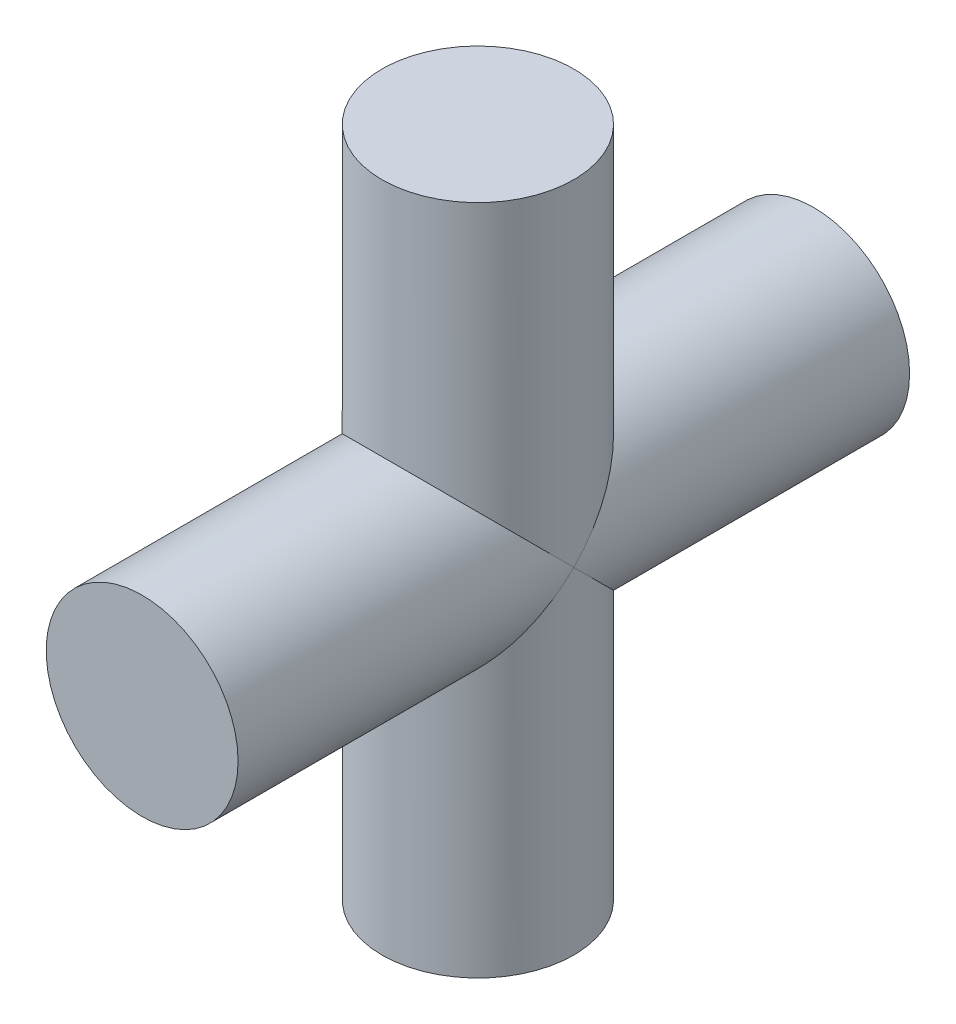
ISO-10303-21;
HEADER;
FILE_DESCRIPTION(('STEP AP214'),'2;1');
FILE_NAME('part.step','',(''),(''),'','','');
FILE_SCHEMA(('AUTOMOTIVE_DESIGN { 1 0 10303 214 1 1 1 1 }'));
ENDSEC;
DATA;
#1=APPLICATION_CONTEXT('core data for automotive mechanical design processes');
#2=APPLICATION_PROTOCOL_DEFINITION('international standard','automotive_design',2000,#1);
#3=PRODUCT_CONTEXT('',#1,'mechanical');
#4=PRODUCT('Part','Part','',(#3));
#5=PRODUCT_RELATED_PRODUCT_CATEGORY('part','',(#4));
#6=PRODUCT_DEFINITION_FORMATION('','',#4);
#7=PRODUCT_DEFINITION_CONTEXT('part definition',#1,'design');
#8=PRODUCT_DEFINITION('design','',#6,#7);
#9=PRODUCT_DEFINITION_SHAPE('','',#8);
#10=(LENGTH_UNIT() NAMED_UNIT(*) SI_UNIT(.MILLI.,.METRE.));
#11=(NAMED_UNIT(*) PLANE_ANGLE_UNIT() SI_UNIT($,.RADIAN.));
#12=(NAMED_UNIT(*) SI_UNIT($,.STERADIAN.) SOLID_ANGLE_UNIT());
#13=UNCERTAINTY_MEASURE_WITH_UNIT(LENGTH_MEASURE(1.E-05),#10,'distance_accuracy_value','');
#14=(GEOMETRIC_REPRESENTATION_CONTEXT(3) GLOBAL_UNCERTAINTY_ASSIGNED_CONTEXT((#13)) GLOBAL_UNIT_ASSIGNED_CONTEXT((#10,
#11,#12)) REPRESENTATION_CONTEXT('',''));
#15=CARTESIAN_POINT('',(0.,0.,0.));
#16=DIRECTION('',(0.,0.,1.));
#17=DIRECTION('',(1.,0.,0.));
#18=AXIS2_PLACEMENT_3D('',#15,#16,#17);
#19=CARTESIAN_POINT('',(0.,0.,-11.1125));
#20=DIRECTION('',(0.,0.,1.));
#21=DIRECTION('',(1.,0.,0.));
#22=AXIS2_PLACEMENT_3D('',#19,#20,#21);
#23=CYLINDRICAL_SURFACE('',#22,3.175);
#24=CARTESIAN_POINT('',(0.,0.,0.));
#25=DIRECTION('',(0.,0.707106781186547,0.707106781186547));
#26=DIRECTION('',(0.,-0.707106781186547,0.707106781186547));
#27=AXIS2_PLACEMENT_3D('',#24,#25,#26);
#28=ELLIPSE('',#27,4.49012806053458,3.175);
#29=CARTESIAN_POINT('',(3.175,0.,0.));
#30=VERTEX_POINT('',#29);
#31=CARTESIAN_POINT('',(-3.175,0.,0.));
#32=VERTEX_POINT('',#31);
#33=EDGE_CURVE('E41',#30,#32,#28,.T.);
#34=ORIENTED_EDGE('',*,*,#33,.F.);
#35=CARTESIAN_POINT('',(0.,0.,0.));
#36=DIRECTION('',(0.,-0.707106781186547,0.707106781186547));
#37=DIRECTION('',(0.,0.707106781186547,0.707106781186547));
#38=AXIS2_PLACEMENT_3D('',#35,#36,#37);
#39=ELLIPSE('',#38,4.49012806053458,3.175);
#40=EDGE_CURVE('E53',#32,#30,#39,.T.);
#41=ORIENTED_EDGE('',*,*,#40,.F.);
#42=EDGE_LOOP('',(#34,#41));
#43=FACE_BOUND('',#42,.T.);
#44=CARTESIAN_POINT('',(0.,0.,-11.1125));
#45=DIRECTION('',(0.,0.,1.));
#46=DIRECTION('',(1.,0.,0.));
#47=AXIS2_PLACEMENT_3D('',#44,#45,#46);
#48=CIRCLE('',#47,3.175);
#49=CARTESIAN_POINT('',(3.175,0.,-11.1125));
#50=VERTEX_POINT('',#49);
#51=EDGE_CURVE('E60',#50,#50,#48,.T.);
#52=ORIENTED_EDGE('',*,*,#51,.T.);
#53=EDGE_LOOP('',(#52));
#54=FACE_BOUND('',#53,.T.);
#55=ADVANCED_FACE('F34',(#43,#54),#23,.T.);
#56=CARTESIAN_POINT('',(0.,0.,-11.1125));
#57=DIRECTION('',(0.,0.,1.));
#58=DIRECTION('',(1.,0.,0.));
#59=AXIS2_PLACEMENT_3D('',#56,#57,#58);
#60=PLANE('',#59);
#61=ORIENTED_EDGE('',*,*,#51,.F.);
#62=EDGE_LOOP('',(#61));
#63=FACE_BOUND('',#62,.T.);
#64=ADVANCED_FACE('F83',(#63),#60,.F.);
#65=CARTESIAN_POINT('',(0.,11.1125,0.));
#66=DIRECTION('',(0.,1.,0.));
#67=DIRECTION('',(0.,0.,1.));
#68=AXIS2_PLACEMENT_3D('',#65,#66,#67);
#69=PLANE('',#68);
#70=CARTESIAN_POINT('',(0.,11.1125,0.));
#71=DIRECTION('',(0.,1.,0.));
#72=DIRECTION('',(0.,0.,1.));
#73=AXIS2_PLACEMENT_3D('',#70,#71,#72);
#74=CIRCLE('',#73,3.175);
#75=CARTESIAN_POINT('',(0.,11.1125,3.175));
#76=VERTEX_POINT('',#75);
#77=EDGE_CURVE('E73',#76,#76,#74,.T.);
#78=ORIENTED_EDGE('',*,*,#77,.T.);
#79=EDGE_LOOP('',(#78));
#80=FACE_BOUND('',#79,.T.);
#81=ADVANCED_FACE('F85',(#80),#69,.T.);
#82=CARTESIAN_POINT('',(0.,-11.1125,0.));
#83=DIRECTION('',(0.,1.,0.));
#84=DIRECTION('',(0.,0.,1.));
#85=AXIS2_PLACEMENT_3D('',#82,#83,#84);
#86=CYLINDRICAL_SURFACE('',#85,3.175);
#87=ORIENTED_EDGE('',*,*,#77,.F.);
#88=EDGE_LOOP('',(#87));
#89=FACE_BOUND('',#88,.T.);
#90=CARTESIAN_POINT('',(0.,0.,0.));
#91=DIRECTION('',(0.,-0.707106781186547,0.707106781186547));
#92=DIRECTION('',(0.,0.707106781186547,0.707106781186547));
#93=AXIS2_PLACEMENT_3D('',#90,#91,#92);
#94=ELLIPSE('',#93,4.49012806053458,3.175);
#95=EDGE_CURVE('E47',#32,#30,#94,.F.);
#96=ORIENTED_EDGE('',*,*,#95,.T.);
#97=ORIENTED_EDGE('',*,*,#33,.T.);
#98=EDGE_LOOP('',(#96,#97));
#99=FACE_BOUND('',#98,.T.);
#100=ADVANCED_FACE('F62',(#89,#99),#86,.T.);
#101=CARTESIAN_POINT('',(0.,0.,11.1125));
#102=DIRECTION('',(0.,0.,1.));
#103=DIRECTION('',(1.,0.,0.));
#104=AXIS2_PLACEMENT_3D('',#101,#102,#103);
#105=PLANE('',#104);
#106=CARTESIAN_POINT('',(0.,0.,11.1125));
#107=DIRECTION('',(0.,0.,1.));
#108=DIRECTION('',(1.,0.,0.));
#109=AXIS2_PLACEMENT_3D('',#106,#107,#108);
#110=CIRCLE('',#109,3.175);
#111=CARTESIAN_POINT('',(3.175,0.,11.1125));
#112=VERTEX_POINT('',#111);
#113=EDGE_CURVE('E72',#112,#112,#110,.T.);
#114=ORIENTED_EDGE('',*,*,#113,.T.);
#115=EDGE_LOOP('',(#114));
#116=FACE_BOUND('',#115,.T.);
#117=ADVANCED_FACE('F93',(#116),#105,.T.);
#118=CARTESIAN_POINT('',(0.,0.,0.));
#119=DIRECTION('',(0.,0.707106781186547,0.707106781186547));
#120=DIRECTION('',(0.,-0.707106781186547,0.707106781186547));
#121=AXIS2_PLACEMENT_3D('',#118,#119,#120);
#122=ELLIPSE('',#121,4.49012806053458,3.175);
#123=EDGE_CURVE('E11',#30,#32,#122,.F.);
#124=ORIENTED_EDGE('',*,*,#123,.F.);
#125=ORIENTED_EDGE('',*,*,#95,.F.);
#126=EDGE_LOOP('',(#124,#125));
#127=FACE_BOUND('',#126,.T.);
#128=ORIENTED_EDGE('',*,*,#113,.F.);
#129=EDGE_LOOP('',(#128));
#130=FACE_BOUND('',#129,.T.);
#131=ADVANCED_FACE('F58',(#127,#130),#23,.T.);
#132=ORIENTED_EDGE('',*,*,#40,.T.);
#133=ORIENTED_EDGE('',*,*,#123,.T.);
#134=EDGE_LOOP('',(#132,#133));
#135=FACE_BOUND('',#134,.T.);
#136=CARTESIAN_POINT('',(0.,-11.1125,0.));
#137=DIRECTION('',(0.,1.,0.));
#138=DIRECTION('',(0.,0.,1.));
#139=AXIS2_PLACEMENT_3D('',#136,#137,#138);
#140=CIRCLE('',#139,3.175);
#141=CARTESIAN_POINT('',(0.,-11.1125,3.175));
#142=VERTEX_POINT('',#141);
#143=EDGE_CURVE('E70',#142,#142,#140,.T.);
#144=ORIENTED_EDGE('',*,*,#143,.T.);
#145=EDGE_LOOP('',(#144));
#146=FACE_BOUND('',#145,.T.);
#147=ADVANCED_FACE('F63',(#135,#146),#86,.T.);
#148=CARTESIAN_POINT('',(0.,-11.1125,0.));
#149=DIRECTION('',(0.,1.,0.));
#150=DIRECTION('',(0.,0.,1.));
#151=AXIS2_PLACEMENT_3D('',#148,#149,#150);
#152=PLANE('',#151);
#153=ORIENTED_EDGE('',*,*,#143,.F.);
#154=EDGE_LOOP('',(#153));
#155=FACE_BOUND('',#154,.T.);
#156=ADVANCED_FACE('F66',(#155),#152,.F.);
#157=CLOSED_SHELL('',(#55,#64,#81,#100,#117,#131,#147,#156));
#158=MANIFOLD_SOLID_BREP('B2',#157);
#159=ADVANCED_BREP_SHAPE_REPRESENTATION('',(#18,#158),#14);
#160=SHAPE_DEFINITION_REPRESENTATION(#9,#159);
ENDSEC;
END-ISO-10303-21;
